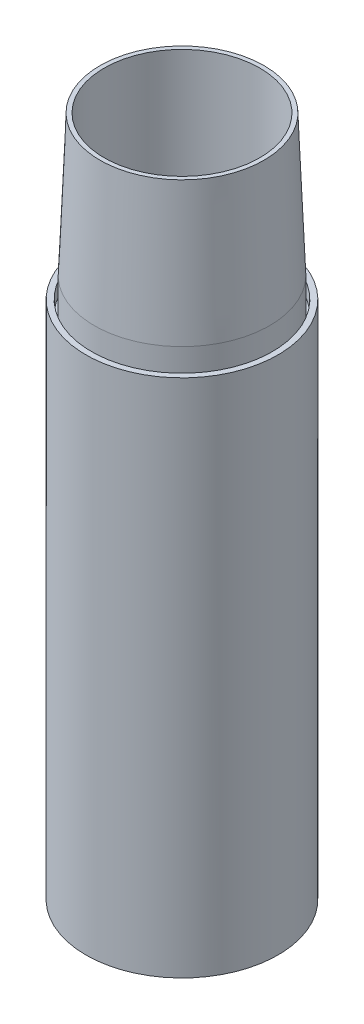
ISO-10303-21;
HEADER;
FILE_DESCRIPTION(('STEP AP214'),'2;1');
FILE_NAME('part.step','',(''),(''),'','','');
FILE_SCHEMA(('AUTOMOTIVE_DESIGN { 1 0 10303 214 1 1 1 1 }'));
ENDSEC;
DATA;
#1=APPLICATION_CONTEXT('core data for automotive mechanical design processes');
#2=APPLICATION_PROTOCOL_DEFINITION('international standard','automotive_design',2000,#1);
#3=PRODUCT_CONTEXT('',#1,'mechanical');
#4=PRODUCT('Part','Part','',(#3));
#5=PRODUCT_RELATED_PRODUCT_CATEGORY('part','',(#4));
#6=PRODUCT_DEFINITION_FORMATION('','',#4);
#7=PRODUCT_DEFINITION_CONTEXT('part definition',#1,'design');
#8=PRODUCT_DEFINITION('design','',#6,#7);
#9=PRODUCT_DEFINITION_SHAPE('','',#8);
#10=(LENGTH_UNIT() NAMED_UNIT(*) SI_UNIT(.MILLI.,.METRE.));
#11=(NAMED_UNIT(*) PLANE_ANGLE_UNIT() SI_UNIT($,.RADIAN.));
#12=(NAMED_UNIT(*) SI_UNIT($,.STERADIAN.) SOLID_ANGLE_UNIT());
#13=UNCERTAINTY_MEASURE_WITH_UNIT(LENGTH_MEASURE(1.E-05),#10,'distance_accuracy_value','');
#14=(GEOMETRIC_REPRESENTATION_CONTEXT(3) GLOBAL_UNCERTAINTY_ASSIGNED_CONTEXT((#13)) GLOBAL_UNIT_ASSIGNED_CONTEXT((#10,
#11,#12)) REPRESENTATION_CONTEXT('',''));
#15=CARTESIAN_POINT('',(0.,0.,0.));
#16=DIRECTION('',(0.,0.,1.));
#17=DIRECTION('',(1.,0.,0.));
#18=AXIS2_PLACEMENT_3D('',#15,#16,#17);
#19=CARTESIAN_POINT('',(0.,70.,0.));
#20=DIRECTION('',(0.,1.,0.));
#21=DIRECTION('',(0.,0.,1.));
#22=AXIS2_PLACEMENT_3D('',#19,#20,#21);
#23=CONICAL_SURFACE('',#22,24.9555,0.03997868712329);
#24=CARTESIAN_POINT('',(0.,30.,0.));
#25=DIRECTION('',(0.,-1.,0.));
#26=DIRECTION('',(0.,0.,-1.));
#27=AXIS2_PLACEMENT_3D('',#24,#25,#26);
#28=CIRCLE('',#27,23.3555);
#29=CARTESIAN_POINT('',(0.,30.,-23.3555));
#30=VERTEX_POINT('',#29);
#31=EDGE_CURVE('E74',#30,#30,#28,.T.);
#32=ORIENTED_EDGE('',*,*,#31,.F.);
#33=EDGE_LOOP('',(#32));
#34=FACE_BOUND('',#33,.T.);
#35=CARTESIAN_POINT('',(0.,70.,0.));
#36=DIRECTION('',(0.,-1.,0.));
#37=DIRECTION('',(0.,0.,-1.));
#38=AXIS2_PLACEMENT_3D('',#35,#36,#37);
#39=CIRCLE('',#38,24.9555);
#40=CARTESIAN_POINT('',(0.,70.,-24.9555));
#41=VERTEX_POINT('',#40);
#42=EDGE_CURVE('E12',#41,#41,#39,.T.);
#43=ORIENTED_EDGE('',*,*,#42,.T.);
#44=EDGE_LOOP('',(#43));
#45=FACE_BOUND('',#44,.T.);
#46=ADVANCED_FACE('F52',(#34,#45),#23,.T.);
#47=CARTESIAN_POINT('',(0.,0.,0.));
#48=DIRECTION('',(0.,-1.,0.));
#49=DIRECTION('',(0.,0.,-1.));
#50=AXIS2_PLACEMENT_3D('',#47,#48,#49);
#51=CYLINDRICAL_SURFACE('',#50,24.9555);
#52=ORIENTED_EDGE('',*,*,#42,.F.);
#53=EDGE_LOOP('',(#52));
#54=FACE_BOUND('',#53,.T.);
#55=CARTESIAN_POINT('',(0.,80.,0.));
#56=DIRECTION('',(0.,-1.,0.));
#57=DIRECTION('',(0.,0.,-1.));
#58=AXIS2_PLACEMENT_3D('',#55,#56,#57);
#59=CIRCLE('',#58,24.9555);
#60=CARTESIAN_POINT('',(0.,80.,-24.9555));
#61=VERTEX_POINT('',#60);
#62=EDGE_CURVE('E58',#61,#61,#59,.T.);
#63=ORIENTED_EDGE('',*,*,#62,.T.);
#64=EDGE_LOOP('',(#63));
#65=FACE_BOUND('',#64,.T.);
#66=ADVANCED_FACE('F81',(#54,#65),#51,.T.);
#67=CARTESIAN_POINT('',(0.,120.,0.));
#68=DIRECTION('',(0.,-1.,0.));
#69=DIRECTION('',(0.,0.,-1.));
#70=AXIS2_PLACEMENT_3D('',#67,#68,#69);
#71=CONICAL_SURFACE('',#70,23.3555,0.0399786871232899);
#72=ORIENTED_EDGE('',*,*,#62,.F.);
#73=EDGE_LOOP('',(#72));
#74=FACE_BOUND('',#73,.T.);
#75=CARTESIAN_POINT('',(0.,120.,0.));
#76=DIRECTION('',(0.,-1.,0.));
#77=DIRECTION('',(0.,0.,-1.));
#78=AXIS2_PLACEMENT_3D('',#75,#76,#77);
#79=CIRCLE('',#78,23.3555);
#80=CARTESIAN_POINT('',(0.,120.,-23.3555));
#81=VERTEX_POINT('',#80);
#82=EDGE_CURVE('E62',#81,#81,#79,.T.);
#83=ORIENTED_EDGE('',*,*,#82,.T.);
#84=EDGE_LOOP('',(#83));
#85=FACE_BOUND('',#84,.T.);
#86=ADVANCED_FACE('F85',(#74,#85),#71,.T.);
#87=CARTESIAN_POINT('',(-23.3555,120.,0.));
#88=DIRECTION('',(0.,-1.,0.));
#89=DIRECTION('',(0.,0.,-1.));
#90=AXIS2_PLACEMENT_3D('',#87,#88,#89);
#91=PLANE('',#90);
#92=ORIENTED_EDGE('',*,*,#82,.F.);
#93=EDGE_LOOP('',(#92));
#94=FACE_BOUND('',#93,.T.);
#95=CARTESIAN_POINT('',(0.,120.,0.));
#96=DIRECTION('',(0.,-1.,0.));
#97=DIRECTION('',(0.,0.,-1.));
#98=AXIS2_PLACEMENT_3D('',#95,#96,#97);
#99=CIRCLE('',#98,22.1555);
#100=CARTESIAN_POINT('',(0.,120.,-22.1555));
#101=VERTEX_POINT('',#100);
#102=EDGE_CURVE('E66',#101,#101,#99,.T.);
#103=ORIENTED_EDGE('',*,*,#102,.T.);
#104=EDGE_LOOP('',(#103));
#105=FACE_BOUND('',#104,.T.);
#106=ADVANCED_FACE('F90',(#94,#105),#91,.F.);
#107=CARTESIAN_POINT('',(0.,0.,0.));
#108=DIRECTION('',(0.,-1.,0.));
#109=DIRECTION('',(0.,0.,-1.));
#110=AXIS2_PLACEMENT_3D('',#107,#108,#109);
#111=CYLINDRICAL_SURFACE('',#110,22.1555);
#112=ORIENTED_EDGE('',*,*,#102,.F.);
#113=EDGE_LOOP('',(#112));
#114=FACE_BOUND('',#113,.T.);
#115=CARTESIAN_POINT('',(0.,30.,0.));
#116=DIRECTION('',(0.,-1.,0.));
#117=DIRECTION('',(0.,0.,-1.));
#118=AXIS2_PLACEMENT_3D('',#115,#116,#117);
#119=CIRCLE('',#118,22.1555);
#120=CARTESIAN_POINT('',(0.,30.,-22.1555));
#121=VERTEX_POINT('',#120);
#122=EDGE_CURVE('E71',#121,#121,#119,.T.);
#123=ORIENTED_EDGE('',*,*,#122,.T.);
#124=EDGE_LOOP('',(#123));
#125=FACE_BOUND('',#124,.T.);
#126=ADVANCED_FACE('F96',(#114,#125),#111,.F.);
#127=CARTESIAN_POINT('',(-22.1555,30.,0.));
#128=DIRECTION('',(0.,1.,0.));
#129=DIRECTION('',(0.,0.,1.));
#130=AXIS2_PLACEMENT_3D('',#127,#128,#129);
#131=PLANE('',#130);
#132=ORIENTED_EDGE('',*,*,#122,.F.);
#133=EDGE_LOOP('',(#132));
#134=FACE_BOUND('',#133,.T.);
#135=ORIENTED_EDGE('',*,*,#31,.T.);
#136=EDGE_LOOP('',(#135));
#137=FACE_BOUND('',#136,.T.);
#138=ADVANCED_FACE('F78',(#134,#137),#131,.F.);
#139=CLOSED_SHELL('',(#46,#66,#86,#106,#126,#138));
#140=MANIFOLD_SOLID_BREP('B2',#139);
#141=CARTESIAN_POINT('',(-25.7555,74.,0.));
#142=DIRECTION('',(0.,-1.,0.));
#143=DIRECTION('',(0.,0.,-1.));
#144=AXIS2_PLACEMENT_3D('',#141,#142,#143);
#145=PLANE('',#144);
#146=CARTESIAN_POINT('',(0.,74.,0.));
#147=DIRECTION('',(0.,-1.,0.));
#148=DIRECTION('',(0.,0.,-1.));
#149=AXIS2_PLACEMENT_3D('',#146,#147,#148);
#150=CIRCLE('',#149,27.3555);
#151=CARTESIAN_POINT('',(0.,74.,-27.3555));
#152=VERTEX_POINT('',#151);
#153=EDGE_CURVE('E290',#152,#152,#150,.T.);
#154=ORIENTED_EDGE('',*,*,#153,.F.);
#155=EDGE_LOOP('',(#154));
#156=FACE_BOUND('',#155,.T.);
#157=CARTESIAN_POINT('',(0.,74.,0.));
#158=DIRECTION('',(0.,-1.,0.));
#159=DIRECTION('',(0.,0.,-1.));
#160=AXIS2_PLACEMENT_3D('',#157,#158,#159);
#161=CIRCLE('',#160,25.7555);
#162=CARTESIAN_POINT('',(0.446614815840973,74.,-25.7516274331599));
#163=VERTEX_POINT('',#162);
#164=CARTESIAN_POINT('',(-0.446614815840973,74.,-25.7516274331599));
#165=VERTEX_POINT('',#164);
#166=EDGE_CURVE('E268',#163,#165,#161,.T.);
#167=ORIENTED_EDGE('',*,*,#166,.T.);
#168=DIRECTION('',(0.347818411576493,0.,-0.937561919325015));
#169=VECTOR('',#168,1.);
#170=CARTESIAN_POINT('',(-11.9060633241085,74.,5.13788899330063));
#171=LINE('',#170,#169);
#172=CARTESIAN_POINT('',(0.,74.,-26.9555));
#173=VERTEX_POINT('',#172);
#174=EDGE_CURVE('E249',#165,#173,#171,.T.);
#175=ORIENTED_EDGE('',*,*,#174,.T.);
#176=DIRECTION('',(0.347818411576493,0.,0.937561919325015));
#177=VECTOR('',#176,1.);
#178=CARTESIAN_POINT('',(5.67438372725962,74.,-11.6599149439853));
#179=LINE('',#178,#177);
#180=EDGE_CURVE('E388',#173,#163,#179,.T.);
#181=ORIENTED_EDGE('',*,*,#180,.T.);
#182=EDGE_LOOP('',(#167,#175,#181));
#183=FACE_BOUND('',#182,.T.);
#184=ADVANCED_FACE('F167',(#156,#183),#145,.F.);
#185=CARTESIAN_POINT('',(0.,0.,0.));
#186=DIRECTION('',(0.,-1.,0.));
#187=DIRECTION('',(0.,0.,-1.));
#188=AXIS2_PLACEMENT_3D('',#185,#186,#187);
#189=CYLINDRICAL_SURFACE('',#188,27.3555);
#190=CARTESIAN_POINT('',(0.,-74.,0.));
#191=DIRECTION('',(0.,1.,0.));
#192=DIRECTION('',(0.,0.,1.));
#193=AXIS2_PLACEMENT_3D('',#190,#191,#192);
#194=CIRCLE('',#193,27.3555);
#195=CARTESIAN_POINT('',(0.,-74.,27.3555));
#196=VERTEX_POINT('',#195);
#197=EDGE_CURVE('E171',#196,#196,#194,.F.);
#198=ORIENTED_EDGE('',*,*,#197,.F.);
#199=EDGE_LOOP('',(#198));
#200=FACE_BOUND('',#199,.T.);
#201=ORIENTED_EDGE('',*,*,#153,.T.);
#202=EDGE_LOOP('',(#201));
#203=FACE_BOUND('',#202,.T.);
#204=ADVANCED_FACE('F348',(#200,#203),#189,.T.);
#205=CARTESIAN_POINT('',(-27.3555,-74.,0.));
#206=DIRECTION('',(0.,1.,0.));
#207=DIRECTION('',(0.,0.,1.));
#208=AXIS2_PLACEMENT_3D('',#205,#206,#207);
#209=PLANE('',#208);
#210=DIRECTION('',(-0.347818411576493,0.,-0.937561919325015));
#211=VECTOR('',#210,1.);
#212=CARTESIAN_POINT('',(5.48081949136907,-74.,-12.1816770200401));
#213=LINE('',#212,#211);
#214=CARTESIAN_POINT('',(0.44661481584098,-74.,-25.7516274331598));
#215=VERTEX_POINT('',#214);
#216=CARTESIAN_POINT('',(0.,-74.,-26.9555));
#217=VERTEX_POINT('',#216);
#218=EDGE_CURVE('E434',#215,#217,#213,.T.);
#219=ORIENTED_EDGE('',*,*,#218,.T.);
#220=DIRECTION('',(-0.347818411576493,0.,0.937561919325015));
#221=VECTOR('',#220,1.);
#222=CARTESIAN_POINT('',(-12.099627559999,-74.,5.6596510693554));
#223=LINE('',#222,#221);
#224=CARTESIAN_POINT('',(-0.44661481584098,-74.,-25.7516274331598));
#225=VERTEX_POINT('',#224);
#226=EDGE_CURVE('E438',#217,#225,#223,.T.);
#227=ORIENTED_EDGE('',*,*,#226,.T.);
#228=CARTESIAN_POINT('',(0.,-74.,0.));
#229=DIRECTION('',(0.,1.,0.));
#230=DIRECTION('',(0.,0.,1.));
#231=AXIS2_PLACEMENT_3D('',#228,#229,#230);
#232=CIRCLE('',#231,25.7555);
#233=EDGE_CURVE('E285',#215,#225,#232,.F.);
#234=ORIENTED_EDGE('',*,*,#233,.F.);
#235=EDGE_LOOP('',(#219,#227,#234));
#236=FACE_BOUND('',#235,.T.);
#237=ORIENTED_EDGE('',*,*,#197,.T.);
#238=EDGE_LOOP('',(#237));
#239=FACE_BOUND('',#238,.T.);
#240=ADVANCED_FACE('F169',(#236,#239),#209,.F.);
#241=CARTESIAN_POINT('',(0.,0.,0.));
#242=DIRECTION('',(0.,-1.,0.));
#243=DIRECTION('',(0.,0.,-1.));
#244=AXIS2_PLACEMENT_3D('',#241,#242,#243);
#245=CYLINDRICAL_SURFACE('',#244,25.7555);
#246=ORIENTED_EDGE('',*,*,#233,.T.);
#247=DIRECTION('',(0.,-1.,0.));
#248=VECTOR('',#247,1.);
#249=CARTESIAN_POINT('',(-0.44661481584098,0.,-25.7516274331598));
#250=LINE('',#249,#248);
#251=CARTESIAN_POINT('',(-0.44661481584098,-70.,-25.7516274331598));
#252=VERTEX_POINT('',#251);
#253=EDGE_CURVE('E211',#225,#252,#250,.F.);
#254=ORIENTED_EDGE('',*,*,#253,.T.);
#255=CARTESIAN_POINT('',(0.,-70.,0.));
#256=DIRECTION('',(0.,-1.,0.));
#257=DIRECTION('',(0.,0.,-1.));
#258=AXIS2_PLACEMENT_3D('',#255,#256,#257);
#259=CIRCLE('',#258,25.7555);
#260=CARTESIAN_POINT('',(0.446614815840974,-70.,-25.7516274331598));
#261=VERTEX_POINT('',#260);
#262=EDGE_CURVE('E282',#261,#252,#259,.T.);
#263=ORIENTED_EDGE('',*,*,#262,.F.);
#264=DIRECTION('',(0.,-1.,0.));
#265=VECTOR('',#264,1.);
#266=CARTESIAN_POINT('',(0.44661481584098,0.,-25.7516274331598));
#267=LINE('',#266,#265);
#268=EDGE_CURVE('E342',#261,#215,#267,.T.);
#269=ORIENTED_EDGE('',*,*,#268,.T.);
#270=EDGE_LOOP('',(#246,#254,#263,#269));
#271=FACE_BOUND('',#270,.T.);
#272=ADVANCED_FACE('F411',(#271),#245,.F.);
#273=CARTESIAN_POINT('',(-24.9555,-70.,0.));
#274=DIRECTION('',(0.,1.,0.));
#275=DIRECTION('',(0.,0.,1.));
#276=AXIS2_PLACEMENT_3D('',#273,#274,#275);
#277=PLANE('',#276);
#278=ORIENTED_EDGE('',*,*,#262,.T.);
#279=DIRECTION('',(-0.347818411576493,0.,0.937561919325015));
#280=VECTOR('',#279,1.);
#281=CARTESIAN_POINT('',(-11.8092812061632,-70.,4.87700795527324));
#282=LINE('',#281,#280);
#283=CARTESIAN_POINT('',(-0.746102174048044,-70.,-24.9443442847448));
#284=VERTEX_POINT('',#283);
#285=EDGE_CURVE('E400',#252,#284,#282,.T.);
#286=ORIENTED_EDGE('',*,*,#285,.T.);
#287=CARTESIAN_POINT('',(0.,-70.,0.));
#288=DIRECTION('',(0.,-1.,0.));
#289=DIRECTION('',(0.,0.,-1.));
#290=AXIS2_PLACEMENT_3D('',#287,#288,#289);
#291=CIRCLE('',#290,24.9555);
#292=CARTESIAN_POINT('',(0.746102174048043,-70.,-24.9443442847448));
#293=VERTEX_POINT('',#292);
#294=EDGE_CURVE('E279',#293,#284,#291,.T.);
#295=ORIENTED_EDGE('',*,*,#294,.F.);
#296=DIRECTION('',(-0.347818411576493,0.,-0.937561919325015));
#297=VECTOR('',#296,1.);
#298=CARTESIAN_POINT('',(5.77116584520489,-70.,-11.3990339059579));
#299=LINE('',#298,#297);
#300=EDGE_CURVE('E447',#293,#261,#299,.T.);
#301=ORIENTED_EDGE('',*,*,#300,.T.);
#302=EDGE_LOOP('',(#278,#286,#295,#301));
#303=FACE_BOUND('',#302,.T.);
#304=ADVANCED_FACE('F407',(#303),#277,.F.);
#305=CARTESIAN_POINT('',(0.,-70.,0.));
#306=DIRECTION('',(0.,-1.,0.));
#307=DIRECTION('',(0.,0.,-1.));
#308=AXIS2_PLACEMENT_3D('',#305,#306,#307);
#309=CONICAL_SURFACE('',#308,24.9555,0.0399786871232897);
#310=ORIENTED_EDGE('',*,*,#294,.T.);
#311=CARTESIAN_POINT('',(-0.746099171549728,-70.0002,-24.9443523781291));
#312=CARTESIAN_POINT('',(-0.796141944074476,-66.6667978893497,-24.80945958265));
#313=CARTESIAN_POINT('',(-0.846250301270814,-63.3334039145014,-24.6743900004094));
#314=CARTESIAN_POINT('',(-0.946606303519952,-56.6666333510345,-24.4038753785468));
#315=CARTESIAN_POINT('',(-0.996853948570488,-53.3332567624158,-24.2684303389308));
#316=CARTESIAN_POINT('',(-1.0974966467452,-46.6665219725292,-23.997142913866));
#317=CARTESIAN_POINT('',(-1.14789169986961,-43.3331637712614,-23.8613005284165));
#318=CARTESIAN_POINT('',(-1.24883838309235,-36.6664669126998,-23.5891936964554));
#319=CARTESIAN_POINT('',(-1.29939001319323,-33.3331282554064,-23.452929249937));
#320=CARTESIAN_POINT('',(-1.3500245154525,-29.9998,-23.316441417372));
#321=B_SPLINE_CURVE_WITH_KNOTS('',3,(#311,#312,#313,#314,#315,#316,#317,#318,#319,#320),
.UNSPECIFIED.,.F.,.F.,(4,2,2,2,4),(0.,10.0095169595683,20.0190337564816,30.0285505689171,
40.0380675440247),.UNSPECIFIED.);
#322=CARTESIAN_POINT('',(-1.35002147736991,-30.,-23.3164496066755));
#323=VERTEX_POINT('',#322);
#324=EDGE_CURVE('E394',#284,#323,#321,.T.);
#325=ORIENTED_EDGE('',*,*,#324,.T.);
#326=CARTESIAN_POINT('',(0.,-30.,0.));
#327=DIRECTION('',(0.,-1.,0.));
#328=DIRECTION('',(0.,0.,-1.));
#329=AXIS2_PLACEMENT_3D('',#326,#327,#328);
#330=CIRCLE('',#329,23.3555);
#331=CARTESIAN_POINT('',(1.35002147736991,-30.,-23.3164496066755));
#332=VERTEX_POINT('',#331);
#333=EDGE_CURVE('E276',#332,#323,#330,.T.);
#334=ORIENTED_EDGE('',*,*,#333,.F.);
#335=CARTESIAN_POINT('',(1.3500245154525,-29.9998,-23.316441417372));
#336=CARTESIAN_POINT('',(1.29939001319324,-33.3331282554064,-23.452929249937));
#337=CARTESIAN_POINT('',(1.24883838309235,-36.6664669126998,-23.5891936964554));
#338=CARTESIAN_POINT('',(1.14789169986961,-43.3331637712614,-23.8613005284165));
#339=CARTESIAN_POINT('',(1.0974966467452,-46.6665219725292,-23.997142913866));
#340=CARTESIAN_POINT('',(0.996853948570486,-53.3332567624158,-24.2684303389308));
#341=CARTESIAN_POINT('',(0.946606303519951,-56.6666333510345,-24.4038753785468));
#342=CARTESIAN_POINT('',(0.846250301270815,-63.3334039145014,-24.6743900004094));
#343=CARTESIAN_POINT('',(0.796141944074477,-66.6667978893497,-24.80945958265));
#344=CARTESIAN_POINT('',(0.746099171549727,-70.0002,-24.9443523781291));
#345=B_SPLINE_CURVE_WITH_KNOTS('',3,(#335,#336,#337,#338,#339,#340,#341,#342,#343,#344),
.UNSPECIFIED.,.F.,.F.,(4,2,2,2,4),(0.,10.0095169751076,20.0190337875431,30.0285505844564,
40.0380675440247),.UNSPECIFIED.);
#346=EDGE_CURVE('E324',#332,#293,#345,.T.);
#347=ORIENTED_EDGE('',*,*,#346,.T.);
#348=EDGE_LOOP('',(#310,#325,#334,#347));
#349=FACE_BOUND('',#348,.T.);
#350=ADVANCED_FACE('F401',(#349),#309,.F.);
#351=CARTESIAN_POINT('',(-23.3555,-30.,0.));
#352=DIRECTION('',(0.,-1.,0.));
#353=DIRECTION('',(0.,0.,-1.));
#354=AXIS2_PLACEMENT_3D('',#351,#352,#353);
#355=PLANE('',#354);
#356=ORIENTED_EDGE('',*,*,#333,.T.);
#357=DIRECTION('',(0.347818411576493,0.,-0.937561919325015));
#358=VECTOR('',#357,1.);
#359=CARTESIAN_POINT('',(-11.6157169702727,-30.,4.35524587921847));
#360=LINE('',#359,#358);
#361=CARTESIAN_POINT('',(-1.08492817836585,-30.,-24.0310218488059));
#362=VERTEX_POINT('',#361);
#363=EDGE_CURVE('E392',#323,#362,#360,.T.);
#364=ORIENTED_EDGE('',*,*,#363,.T.);
#365=CARTESIAN_POINT('',(0.,-30.,0.));
#366=DIRECTION('',(0.,-1.,0.));
#367=DIRECTION('',(0.,0.,-1.));
#368=AXIS2_PLACEMENT_3D('',#365,#366,#367);
#369=CIRCLE('',#368,24.0555);
#370=CARTESIAN_POINT('',(1.08492817836585,-30.,-24.0310218488059));
#371=VERTEX_POINT('',#370);
#372=EDGE_CURVE('E296',#362,#371,#369,.F.);
#373=ORIENTED_EDGE('',*,*,#372,.T.);
#374=DIRECTION('',(0.347818411576493,0.,0.937561919325015));
#375=VECTOR('',#374,1.);
#376=CARTESIAN_POINT('',(5.96473008109545,-30.,-10.8772718299032));
#377=LINE('',#376,#375);
#378=EDGE_CURVE('E186',#371,#332,#377,.T.);
#379=ORIENTED_EDGE('',*,*,#378,.T.);
#380=EDGE_LOOP('',(#356,#364,#373,#379));
#381=FACE_BOUND('',#380,.T.);
#382=ADVANCED_FACE('F406',(#381),#355,.F.);
#383=CARTESIAN_POINT('',(0.,0.,0.));
#384=DIRECTION('',(0.,-1.,0.));
#385=DIRECTION('',(0.,0.,-1.));
#386=AXIS2_PLACEMENT_3D('',#383,#384,#385);
#387=CYLINDRICAL_SURFACE('',#386,26.5555);
#388=CARTESIAN_POINT('',(0.,-27.5,0.));
#389=DIRECTION('',(0.,-1.,0.));
#390=DIRECTION('',(0.,0.,-1.));
#391=AXIS2_PLACEMENT_3D('',#388,#389,#390);
#392=CIRCLE('',#391,26.5555);
#393=CARTESIAN_POINT('',(0.148546855337924,-27.5,-26.5550845240939));
#394=VERTEX_POINT('',#393);
#395=CARTESIAN_POINT('',(-0.148546855337921,-27.5,-26.5550845240939));
#396=VERTEX_POINT('',#395);
#397=EDGE_CURVE('E289',#394,#396,#392,.T.);
#398=ORIENTED_EDGE('',*,*,#397,.T.);
#399=DIRECTION('',(0.,-1.,0.));
#400=VECTOR('',#399,1.);
#401=CARTESIAN_POINT('',(-0.148546855337923,0.,-26.5550845240939));
#402=LINE('',#401,#400);
#403=CARTESIAN_POINT('',(-0.148546855337923,27.5,-26.5550845240939));
#404=VERTEX_POINT('',#403);
#405=EDGE_CURVE('E389',#396,#404,#402,.F.);
#406=ORIENTED_EDGE('',*,*,#405,.T.);
#407=CARTESIAN_POINT('',(0.,27.5,0.));
#408=DIRECTION('',(0.,1.,0.));
#409=DIRECTION('',(0.,0.,1.));
#410=AXIS2_PLACEMENT_3D('',#407,#408,#409);
#411=CIRCLE('',#410,26.5555);
#412=CARTESIAN_POINT('',(0.148546855337923,27.5,-26.5550845240939));
#413=VERTEX_POINT('',#412);
#414=EDGE_CURVE('E293',#404,#413,#411,.T.);
#415=ORIENTED_EDGE('',*,*,#414,.T.);
#416=DIRECTION('',(0.,-1.,0.));
#417=VECTOR('',#416,1.);
#418=CARTESIAN_POINT('',(0.148546855337923,0.,-26.5550845240939));
#419=LINE('',#418,#417);
#420=EDGE_CURVE('E452',#413,#394,#419,.T.);
#421=ORIENTED_EDGE('',*,*,#420,.T.);
#422=EDGE_LOOP('',(#398,#406,#415,#421));
#423=FACE_BOUND('',#422,.T.);
#424=ADVANCED_FACE('F461',(#423),#387,.F.);
#425=CARTESIAN_POINT('',(-26.5555,30.,0.));
#426=DIRECTION('',(0.,1.,0.));
#427=DIRECTION('',(0.,0.,1.));
#428=AXIS2_PLACEMENT_3D('',#425,#426,#427);
#429=PLANE('',#428);
#430=CARTESIAN_POINT('',(0.,30.,0.));
#431=DIRECTION('',(0.,1.,0.));
#432=DIRECTION('',(0.,0.,1.));
#433=AXIS2_PLACEMENT_3D('',#430,#431,#432);
#434=CIRCLE('',#433,24.0555);
#435=CARTESIAN_POINT('',(1.08492817836585,30.,-24.0310218488059));
#436=VERTEX_POINT('',#435);
#437=CARTESIAN_POINT('',(-1.08492817836585,30.,-24.0310218488059));
#438=VERTEX_POINT('',#437);
#439=EDGE_CURVE('E286',#436,#438,#434,.F.);
#440=ORIENTED_EDGE('',*,*,#439,.T.);
#441=DIRECTION('',(-0.347818411576493,0.,0.937561919325015));
#442=VECTOR('',#441,1.);
#443=CARTESIAN_POINT('',(-12.0028454420538,30.,5.39877003132802));
#444=LINE('',#443,#442);
#445=CARTESIAN_POINT('',(-1.3500214773699,30.,-23.3164496066755));
#446=VERTEX_POINT('',#445);
#447=EDGE_CURVE('E360',#438,#446,#444,.T.);
#448=ORIENTED_EDGE('',*,*,#447,.T.);
#449=CARTESIAN_POINT('',(0.,30.,0.));
#450=DIRECTION('',(0.,-1.,0.));
#451=DIRECTION('',(0.,0.,-1.));
#452=AXIS2_PLACEMENT_3D('',#449,#450,#451);
#453=CIRCLE('',#452,23.3555);
#454=CARTESIAN_POINT('',(1.35002147736991,30.,-23.3164496066755));
#455=VERTEX_POINT('',#454);
#456=EDGE_CURVE('E270',#455,#446,#453,.T.);
#457=ORIENTED_EDGE('',*,*,#456,.F.);
#458=DIRECTION('',(-0.347818411576493,0.,-0.937561919325015));
#459=VECTOR('',#458,1.);
#460=CARTESIAN_POINT('',(5.57760160931435,30.,-11.9207959820127));
#461=LINE('',#460,#459);
#462=EDGE_CURVE('E341',#455,#436,#461,.T.);
#463=ORIENTED_EDGE('',*,*,#462,.T.);
#464=EDGE_LOOP('',(#440,#448,#457,#463));
#465=FACE_BOUND('',#464,.T.);
#466=ADVANCED_FACE('F374',(#465),#429,.F.);
#467=CARTESIAN_POINT('',(0.,30.,0.));
#468=DIRECTION('',(0.,1.,0.));
#469=DIRECTION('',(0.,0.,1.));
#470=AXIS2_PLACEMENT_3D('',#467,#468,#469);
#471=CONICAL_SURFACE('',#470,23.3555,0.03997868712329);
#472=ORIENTED_EDGE('',*,*,#456,.T.);
#473=CARTESIAN_POINT('',(-1.35002451545249,29.9998,-23.316441417372));
#474=CARTESIAN_POINT('',(-1.29939001319323,33.3331282554064,-23.452929249937));
#475=CARTESIAN_POINT('',(-1.24883838309235,36.6664669126998,-23.5891936964554));
#476=CARTESIAN_POINT('',(-1.14789169986961,43.3331637712614,-23.8613005284165));
#477=CARTESIAN_POINT('',(-1.0974966467452,46.6665219725292,-23.997142913866));
#478=CARTESIAN_POINT('',(-0.996853948570483,53.3332567624158,-24.2684303389308));
#479=CARTESIAN_POINT('',(-0.946606303519947,56.6666333510345,-24.4038753785468));
#480=CARTESIAN_POINT('',(-0.846250301270808,63.3334039145014,-24.6743900004095));
#481=CARTESIAN_POINT('',(-0.79614194407447,66.6667978893497,-24.8094595826501));
#482=CARTESIAN_POINT('',(-0.746099171549722,70.0002,-24.9443523781291));
#483=B_SPLINE_CURVE_WITH_KNOTS('',3,(#473,#474,#475,#476,#477,#478,#479,#480,#481,#482),
.UNSPECIFIED.,.F.,.F.,(4,2,2,2,4),(0.,10.0095169751076,20.0190337875431,30.0285505844564,
40.0380675440247),.UNSPECIFIED.);
#484=CARTESIAN_POINT('',(-0.746102174048038,70.,-24.9443442847448));
#485=VERTEX_POINT('',#484);
#486=EDGE_CURVE('E263',#446,#485,#483,.T.);
#487=ORIENTED_EDGE('',*,*,#486,.T.);
#488=CARTESIAN_POINT('',(0.,70.,0.));
#489=DIRECTION('',(0.,-1.,0.));
#490=DIRECTION('',(0.,0.,-1.));
#491=AXIS2_PLACEMENT_3D('',#488,#489,#490);
#492=CIRCLE('',#491,24.9555);
#493=CARTESIAN_POINT('',(0.746102174048038,70.,-24.9443442847448));
#494=VERTEX_POINT('',#493);
#495=EDGE_CURVE('E262',#494,#485,#492,.T.);
#496=ORIENTED_EDGE('',*,*,#495,.F.);
#497=CARTESIAN_POINT('',(0.746099171549722,70.0002,-24.9443523781291));
#498=CARTESIAN_POINT('',(0.79614194407447,66.6667978893497,-24.8094595826501));
#499=CARTESIAN_POINT('',(0.846250301270808,63.3334039145014,-24.6743900004095));
#500=CARTESIAN_POINT('',(0.946606303519946,56.6666333510345,-24.4038753785468));
#501=CARTESIAN_POINT('',(0.996853948570483,53.3332567624158,-24.2684303389308));
#502=CARTESIAN_POINT('',(1.0974966467452,46.6665219725292,-23.997142913866));
#503=CARTESIAN_POINT('',(1.14789169986961,43.3331637712614,-23.8613005284165));
#504=CARTESIAN_POINT('',(1.24883838309235,36.6664669126998,-23.5891936964554));
#505=CARTESIAN_POINT('',(1.29939001319323,33.3331282554064,-23.452929249937));
#506=CARTESIAN_POINT('',(1.35002451545249,29.9998,-23.316441417372));
#507=B_SPLINE_CURVE_WITH_KNOTS('',3,(#497,#498,#499,#500,#501,#502,#503,#504,#505,#506),
.UNSPECIFIED.,.F.,.F.,(4,2,2,2,4),(0.,10.0095169595683,20.0190337564816,30.0285505689172,
40.0380675440247),.UNSPECIFIED.);
#508=EDGE_CURVE('E378',#494,#455,#507,.T.);
#509=ORIENTED_EDGE('',*,*,#508,.T.);
#510=EDGE_LOOP('',(#472,#487,#496,#509));
#511=FACE_BOUND('',#510,.T.);
#512=ADVANCED_FACE('F369',(#511),#471,.F.);
#513=CARTESIAN_POINT('',(-24.9555,70.,0.));
#514=DIRECTION('',(0.,-1.,0.));
#515=DIRECTION('',(0.,0.,-1.));
#516=AXIS2_PLACEMENT_3D('',#513,#514,#515);
#517=PLANE('',#516);
#518=ORIENTED_EDGE('',*,*,#495,.T.);
#519=DIRECTION('',(0.347818411576493,0.,-0.937561919325015));
#520=VECTOR('',#519,1.);
#521=CARTESIAN_POINT('',(-11.8092812061632,70.,4.87700795527324));
#522=LINE('',#521,#520);
#523=CARTESIAN_POINT('',(-0.446614815840971,70.,-25.7516274331599));
#524=VERTEX_POINT('',#523);
#525=EDGE_CURVE('E242',#485,#524,#522,.T.);
#526=ORIENTED_EDGE('',*,*,#525,.T.);
#527=CARTESIAN_POINT('',(0.,70.,0.));
#528=DIRECTION('',(0.,-1.,0.));
#529=DIRECTION('',(0.,0.,-1.));
#530=AXIS2_PLACEMENT_3D('',#527,#528,#529);
#531=CIRCLE('',#530,25.7555);
#532=CARTESIAN_POINT('',(0.446614815840971,70.,-25.7516274331599));
#533=VERTEX_POINT('',#532);
#534=EDGE_CURVE('E260',#533,#524,#531,.T.);
#535=ORIENTED_EDGE('',*,*,#534,.F.);
#536=DIRECTION('',(0.347818411576493,0.,0.937561919325015));
#537=VECTOR('',#536,1.);
#538=CARTESIAN_POINT('',(5.7711658452049,70.,-11.3990339059579));
#539=LINE('',#538,#537);
#540=EDGE_CURVE('E385',#533,#494,#539,.T.);
#541=ORIENTED_EDGE('',*,*,#540,.T.);
#542=EDGE_LOOP('',(#518,#526,#535,#541));
#543=FACE_BOUND('',#542,.T.);
#544=ADVANCED_FACE('F258',(#543),#517,.F.);
#545=CARTESIAN_POINT('',(0.,0.,0.));
#546=DIRECTION('',(0.,-1.,0.));
#547=DIRECTION('',(0.,0.,-1.));
#548=AXIS2_PLACEMENT_3D('',#545,#546,#547);
#549=CYLINDRICAL_SURFACE('',#548,25.7555);
#550=ORIENTED_EDGE('',*,*,#534,.T.);
#551=DIRECTION('',(0.,-1.,0.));
#552=VECTOR('',#551,1.);
#553=CARTESIAN_POINT('',(-0.446614815840973,0.,-25.7516274331599));
#554=LINE('',#553,#552);
#555=EDGE_CURVE('E245',#524,#165,#554,.F.);
#556=ORIENTED_EDGE('',*,*,#555,.T.);
#557=ORIENTED_EDGE('',*,*,#166,.F.);
#558=DIRECTION('',(0.,-1.,0.));
#559=VECTOR('',#558,1.);
#560=CARTESIAN_POINT('',(0.446614815840973,0.,-25.7516274331599));
#561=LINE('',#560,#559);
#562=EDGE_CURVE('E267',#163,#533,#561,.T.);
#563=ORIENTED_EDGE('',*,*,#562,.T.);
#564=EDGE_LOOP('',(#550,#556,#557,#563));
#565=FACE_BOUND('',#564,.T.);
#566=ADVANCED_FACE('F266',(#565),#549,.F.);
#567=CARTESIAN_POINT('',(0.,27.5,0.));
#568=DIRECTION('',(0.,1.,0.));
#569=DIRECTION('',(0.,0.,1.));
#570=AXIS2_PLACEMENT_3D('',#567,#568,#569);
#571=TOROIDAL_SURFACE('',#570,24.0555,2.5);
#572=ORIENTED_EDGE('',*,*,#414,.F.);
#573=CARTESIAN_POINT('',(-0.148546858311995,27.4998,-26.5550845160771));
#574=CARTESIAN_POINT('',(-0.148541650009914,27.5667525358084,-26.5550985553158));
#575=CARTESIAN_POINT('',(-0.149542698686776,27.6337008663729,-26.5524001785548));
#576=CARTESIAN_POINT('',(-0.153532610004685,27.7670952144746,-26.5416451731019));
#577=CARTESIAN_POINT('',(-0.156521139959754,27.8335413141984,-26.5335894411815));
#578=CARTESIAN_POINT('',(-0.164452034827259,27.9653056250664,-26.5122113175214));
#579=CARTESIAN_POINT('',(-0.169389809610809,28.030626112381,-26.4989012987036));
#580=CARTESIAN_POINT('',(-0.181166747337277,28.1598162965515,-26.467155974215));
#581=CARTESIAN_POINT('',(-0.18800593031418,28.2236859781135,-26.4487206145416));
#582=CARTESIAN_POINT('',(-0.211287490297005,28.4124360419367,-26.3859640055299));
#583=CARTESIAN_POINT('',(-0.230502021682905,28.5345909792179,-26.3341702754526));
#584=CARTESIAN_POINT('',(-0.2756141874473,28.768145595486,-26.2125681770264));
#585=CARTESIAN_POINT('',(-0.30151345996552,28.8795426289701,-26.1427553929899));
#586=CARTESIAN_POINT('',(-0.359865078216107,29.0916892737886,-25.9854656884146));
#587=CARTESIAN_POINT('',(-0.392465050254419,29.192103117995,-25.8975908337867));
#588=CARTESIAN_POINT('',(-0.462764934581508,29.3768743737384,-25.7080939805888));
#589=CARTESIAN_POINT('',(-0.50046643890948,29.4612267531013,-25.6064676905975));
#590=CARTESIAN_POINT('',(-0.582336995854158,29.6170195890342,-25.3857815108253));
#591=CARTESIAN_POINT('',(-0.626760714749696,29.6873531329829,-25.2660351553564));
#592=CARTESIAN_POINT('',(-0.718883179314375,29.8071553691858,-25.0177144459991));
#593=CARTESIAN_POINT('',(-0.766582756641537,29.8566187400896,-24.8891378503349));
#594=CARTESIAN_POINT('',(-0.867404652083363,29.9367814023443,-24.6173673900767));
#595=CARTESIAN_POINT('',(-0.920674132309862,29.9659524841599,-24.4737768426521));
#596=CARTESIAN_POINT('',(-1.02815147532137,29.9996063704369,-24.1840662906975));
#597=CARTESIAN_POINT('',(-1.08235964579671,30.0040809199275,-24.0379454567727));
#598=CARTESIAN_POINT('',(-1.19324466009041,29.9880875290893,-23.7390493564933));
#599=CARTESIAN_POINT('',(-1.2498984992783,29.9662729588722,-23.5863361002704));
#600=CARTESIAN_POINT('',(-1.36117965839023,29.8959616318784,-23.2863721718262));
#601=CARTESIAN_POINT('',(-1.41580657260679,29.8474595637816,-23.1391225932098));
#602=CARTESIAN_POINT('',(-1.52205132173186,29.7239441167321,-22.8527345597057));
#603=CARTESIAN_POINT('',(-1.57362773453726,29.6486346970136,-22.7137077601681));
#604=CARTESIAN_POINT('',(-1.67135726912972,29.4729829481828,-22.4502729131974));
#605=CARTESIAN_POINT('',(-1.71751157222497,29.3726460867013,-22.325861681489));
#606=CARTESIAN_POINT('',(-1.80047616465836,29.1545650917577,-22.1022264743551));
#607=CARTESIAN_POINT('',(-1.83763421244141,29.0379188899274,-22.0020650986536));
#608=CARTESIAN_POINT('',(-1.90375616678998,28.7867304449297,-21.8238300646093));
#609=CARTESIAN_POINT('',(-1.93272296775066,28.6521945478931,-21.7457486042797));
#610=CARTESIAN_POINT('',(-1.97863579415672,28.3826445980708,-21.6219882850608));
#611=CARTESIAN_POINT('',(-1.99645930895117,28.2488779889872,-21.5739441097567));
#612=CARTESIAN_POINT('',(-2.01650139557148,28.0431579439752,-21.5199196631673));
#613=CARTESIAN_POINT('',(-2.02206526652355,27.9737813804559,-21.5049219708224));
#614=CARTESIAN_POINT('',(-2.03090666766057,27.8338482746271,-21.4810895319875));
#615=CARTESIAN_POINT('',(-2.03418575976124,27.7632925722517,-21.4722505752756));
#616=CARTESIAN_POINT('',(-2.03725474126573,27.6604165763307,-21.4639779821811));
#617=CARTESIAN_POINT('',(-2.03797206210259,27.6283036558956,-21.4620444079994));
#618=CARTESIAN_POINT('',(-2.03892708389598,27.5640622426492,-21.4594700990042));
#619=CARTESIAN_POINT('',(-2.03916542939085,27.5319338290355,-21.4588276268055));
#620=CARTESIAN_POINT('',(-2.03916451700837,27.4998,-21.4588300861781));
#621=B_SPLINE_CURVE_WITH_KNOTS('',3,(#573,#574,#575,#576,#577,#578,#579,#580,#581,#582,#583,
#584,#585,#586,#587,#588,#589,#590,#591,#592,#593,#594,#595,#596,#597,#598,#599,#600,#601,#602,
#603,#604,#605,#606,#607,#608,#609,#610,#611,#612,#613,#614,#615,#616,#617,#618,#619,#620),
.UNSPECIFIED.,.F.,.F.,(4,2,2,2,2,2,2,2,2,2,2,2,2,2,2,2,2,2,2,2,2,2,2,4),(0.,0.200787846831293,
0.401542092091603,0.60182638969364,0.802112797649744,1.20228403427498,1.60255342875153,
2.0128285320185,2.42323196672021,2.85876562203297,3.29441026006841,3.7600802047043,
4.22590579301415,4.71664204477528,5.20747599773667,5.70390768249485,6.20023100893526,
6.67216044064492,7.14392290607685,7.57108891004552,7.7844239855902,7.99761307799176,
8.09412624868545,8.19050945819036),.UNSPECIFIED.);
#622=EDGE_CURVE('E352',#404,#438,#621,.T.);
#623=ORIENTED_EDGE('',*,*,#622,.T.);
#624=ORIENTED_EDGE('',*,*,#439,.F.);
#625=CARTESIAN_POINT('',(2.03916451700837,27.4998,-21.4588300861781));
#626=CARTESIAN_POINT('',(2.03917058726021,27.5652652409862,-21.4588137235107));
#627=CARTESIAN_POINT('',(2.03817539496882,27.6307249922197,-21.4614963140918));
#628=CARTESIAN_POINT('',(2.03421350778093,27.7611318374012,-21.4721757791011));
#629=CARTESIAN_POINT('',(2.03124735911592,27.8260790683443,-21.4801711811351));
#630=CARTESIAN_POINT('',(2.02338840656333,27.954769119424,-21.5013553806882));
#631=CARTESIAN_POINT('',(2.01850242091157,28.0185153742331,-21.5145257993118));
#632=CARTESIAN_POINT('',(2.00686623257671,28.1445690707214,-21.5458917267778));
#633=CARTESIAN_POINT('',(2.00011596762434,28.2068764642655,-21.5640874034702));
#634=CARTESIAN_POINT('',(1.97718343007595,28.3909166582671,-21.6259032050588));
#635=CARTESIAN_POINT('',(1.9583069910339,28.5099669681648,-21.6767855903186));
#636=CARTESIAN_POINT('',(1.91415629851461,28.7377688091761,-21.7957959895389));
#637=CARTESIAN_POINT('',(1.8888780081875,28.8465137823182,-21.8639348850302));
#638=CARTESIAN_POINT('',(1.83160909112771,29.0559597360822,-22.0183061144107));
#639=CARTESIAN_POINT('',(1.7993763444664,29.1561128771869,-22.1051910946736));
#640=CARTESIAN_POINT('',(1.72997220051894,29.3410686192019,-22.2922734348912));
#641=CARTESIAN_POINT('',(1.69279907645213,29.4258658282489,-22.3924754494695));
#642=CARTESIAN_POINT('',(1.61086171489897,29.5860327968405,-22.6133417044041));
#643=CARTESIAN_POINT('',(1.56571258340152,29.6597757139396,-22.735043445812));
#644=CARTESIAN_POINT('',(1.47199090895003,29.7862806091797,-22.9876749053797));
#645=CARTESIAN_POINT('',(1.4234171634377,29.8390351735963,-23.1186078650955));
#646=CARTESIAN_POINT('',(1.32009447057841,29.9261089946086,-23.3971193498324));
#647=CARTESIAN_POINT('',(1.26516149879004,29.9586308558197,-23.5451939219365));
#648=CARTESIAN_POINT('',(1.15417970183512,29.9976524755535,-23.8443509047183));
#649=CARTESIAN_POINT('',(1.09813056659954,30.0041448988524,-23.9954341512026));
#650=CARTESIAN_POINT('',(0.984567518691554,29.9905245577652,-24.301549024991));
#651=CARTESIAN_POINT('',(0.927065871600374,29.9695320315923,-24.4565475898076));
#652=CARTESIAN_POINT('',(0.81416281002051,29.8994232534045,-24.7608834374492));
#653=CARTESIAN_POINT('',(0.75876129005546,29.8503084157995,-24.910221004591));
#654=CARTESIAN_POINT('',(0.653119048178008,29.7260917254712,-25.1949849496838));
#655=CARTESIAN_POINT('',(0.602787105442015,29.6516336695331,-25.3306572179258));
#656=CARTESIAN_POINT('',(0.507591876649127,29.4779069491724,-25.5872607168984));
#657=CARTESIAN_POINT('',(0.462726304330774,29.3786487105667,-25.7081981103612));
#658=CARTESIAN_POINT('',(0.382861749625062,29.1648163009013,-25.9234770107982));
#659=CARTESIAN_POINT('',(0.347416023047961,29.0516224896769,-26.0190227390731));
#660=CARTESIAN_POINT('',(0.284246842247317,28.8085579914595,-26.1892984243802));
#661=CARTESIAN_POINT('',(0.256522271913843,28.6786897187656,-26.2640313899426));
#662=CARTESIAN_POINT('',(0.211669951000321,28.416087194132,-26.3849330635811));
#663=CARTESIAN_POINT('',(0.193927774763012,28.2842169028993,-26.4327579867375));
#664=CARTESIAN_POINT('',(0.166892537974893,28.0136370731841,-26.5056328192618));
#665=CARTESIAN_POINT('',(0.15758219431775,27.8749421419278,-26.5307293161068));
#666=CARTESIAN_POINT('',(0.151292927963295,27.6960545028676,-26.5476823480285));
#667=CARTESIAN_POINT('',(0.150261768039859,27.6568305785553,-26.5504618911601));
#668=CARTESIAN_POINT('',(0.148889175687666,27.5783433814255,-26.5541617824751));
#669=CARTESIAN_POINT('',(0.148546687283434,27.5390802613523,-26.5550849770931));
#670=CARTESIAN_POINT('',(0.148546858311995,27.4998,-26.5550845160771));
#671=B_SPLINE_CURVE_WITH_KNOTS('',3,(#625,#626,#627,#628,#629,#630,#631,#632,#633,#634,#635,
#636,#637,#638,#639,#640,#641,#642,#643,#644,#645,#646,#647,#648,#649,#650,#651,#652,#653,#654,
#655,#656,#657,#658,#659,#660,#661,#662,#663,#664,#665,#666,#667,#668,#669,#670),.UNSPECIFIED.,
.F.,.F.,(4,2,2,2,2,2,2,2,2,2,2,2,2,2,2,2,2,2,2,2,2,2,4),(0.,0.196323275483047,0.392592164549002,
0.588170221625789,0.783754812046919,1.17432369331709,1.56513947360933,1.97278005978375,
2.3805635027088,2.82654010111947,3.27267409245561,3.75424856187313,4.23595873181413,
4.73347125536908,5.23095875875884,5.71665023507139,6.20213787274649,6.65666565158156,
7.11112769329407,7.53319920941463,7.95440361551513,8.07237858882074,8.19017252666082),.UNSPECIFIED.);
#672=EDGE_CURVE('E333',#436,#413,#671,.T.);
#673=ORIENTED_EDGE('',*,*,#672,.T.);
#674=EDGE_LOOP('',(#572,#623,#624,#673));
#675=FACE_BOUND('',#674,.T.);
#676=ADVANCED_FACE('F343',(#675),#571,.F.);
#677=CARTESIAN_POINT('',(0.,-27.5,0.));
#678=DIRECTION('',(0.,-1.,0.));
#679=DIRECTION('',(0.,0.,-1.));
#680=AXIS2_PLACEMENT_3D('',#677,#678,#679);
#681=TOROIDAL_SURFACE('',#680,24.0555,2.5);
#682=ORIENTED_EDGE('',*,*,#372,.F.);
#683=CARTESIAN_POINT('',(-2.03916451700837,-27.4998,-21.4588300861781));
#684=CARTESIAN_POINT('',(-2.03917058726021,-27.5652652409862,-21.4588137235107));
#685=CARTESIAN_POINT('',(-2.03817539496882,-27.6307249922198,-21.4614963140918));
#686=CARTESIAN_POINT('',(-2.03421350778093,-27.7611318374012,-21.4721757791011));
#687=CARTESIAN_POINT('',(-2.03124735911591,-27.8260790683443,-21.4801711811351));
#688=CARTESIAN_POINT('',(-2.02338840656333,-27.954769119424,-21.5013553806882));
#689=CARTESIAN_POINT('',(-2.01850242091157,-28.0185153742331,-21.5145257993118));
#690=CARTESIAN_POINT('',(-2.00686623257671,-28.1445690707214,-21.5458917267778));
#691=CARTESIAN_POINT('',(-2.00011596762434,-28.2068764642655,-21.5640874034702));
#692=CARTESIAN_POINT('',(-1.97718343007594,-28.3909166582671,-21.6259032050588));
#693=CARTESIAN_POINT('',(-1.9583069910339,-28.5099669681648,-21.6767855903186));
#694=CARTESIAN_POINT('',(-1.91415629851461,-28.7377688091761,-21.7957959895389));
#695=CARTESIAN_POINT('',(-1.8888780081875,-28.8465137823182,-21.8639348850302));
#696=CARTESIAN_POINT('',(-1.83160909112771,-29.0559597360822,-22.0183061144107));
#697=CARTESIAN_POINT('',(-1.7993763444664,-29.1561128771869,-22.1051910946736));
#698=CARTESIAN_POINT('',(-1.72997220051895,-29.3410686192019,-22.2922734348912));
#699=CARTESIAN_POINT('',(-1.69279907645213,-29.4258658282489,-22.3924754494695));
#700=CARTESIAN_POINT('',(-1.61086171489897,-29.5860327968405,-22.6133417044041));
#701=CARTESIAN_POINT('',(-1.56571258340152,-29.6597757139396,-22.735043445812));
#702=CARTESIAN_POINT('',(-1.47199090895004,-29.7862806091797,-22.9876749053797));
#703=CARTESIAN_POINT('',(-1.4234171634377,-29.8390351735964,-23.1186078650955));
#704=CARTESIAN_POINT('',(-1.32009447057841,-29.9261089946086,-23.3971193498324));
#705=CARTESIAN_POINT('',(-1.26516149879004,-29.9586308558197,-23.5451939219365));
#706=CARTESIAN_POINT('',(-1.15417970183513,-29.9976524755535,-23.8443509047183));
#707=CARTESIAN_POINT('',(-1.09813056659954,-30.0041448988525,-23.9954341512026));
#708=CARTESIAN_POINT('',(-0.984567518691553,-29.9905245577652,-24.301549024991));
#709=CARTESIAN_POINT('',(-0.927065871600373,-29.9695320315923,-24.4565475898076));
#710=CARTESIAN_POINT('',(-0.81416281002051,-29.8994232534045,-24.7608834374492));
#711=CARTESIAN_POINT('',(-0.75876129005546,-29.8503084157995,-24.910221004591));
#712=CARTESIAN_POINT('',(-0.653119048178008,-29.7260917254712,-25.1949849496838));
#713=CARTESIAN_POINT('',(-0.602787105442015,-29.6516336695331,-25.3306572179258));
#714=CARTESIAN_POINT('',(-0.507591876649127,-29.4779069491724,-25.5872607168984));
#715=CARTESIAN_POINT('',(-0.462726304330774,-29.3786487105667,-25.7081981103612));
#716=CARTESIAN_POINT('',(-0.382861749625061,-29.1648163009013,-25.9234770107982));
#717=CARTESIAN_POINT('',(-0.347416023047959,-29.0516224896769,-26.0190227390731));
#718=CARTESIAN_POINT('',(-0.284246842247316,-28.8085579914595,-26.1892984243802));
#719=CARTESIAN_POINT('',(-0.256522271913843,-28.6786897187657,-26.2640313899426));
#720=CARTESIAN_POINT('',(-0.211669951000322,-28.416087194132,-26.3849330635811));
#721=CARTESIAN_POINT('',(-0.193927774763013,-28.2842169028993,-26.4327579867375));
#722=CARTESIAN_POINT('',(-0.166892537974893,-28.0136370731841,-26.5056328192618));
#723=CARTESIAN_POINT('',(-0.157582194317748,-27.8749421419278,-26.5307293161068));
#724=CARTESIAN_POINT('',(-0.151292927963294,-27.6960545028676,-26.5476823480285));
#725=CARTESIAN_POINT('',(-0.150261768039859,-27.6568305785553,-26.5504618911601));
#726=CARTESIAN_POINT('',(-0.148889175687667,-27.5783433814255,-26.5541617824751));
#727=CARTESIAN_POINT('',(-0.148546687283435,-27.5390802613523,-26.5550849770931));
#728=CARTESIAN_POINT('',(-0.148546858311995,-27.4998,-26.5550845160771));
#729=B_SPLINE_CURVE_WITH_KNOTS('',3,(#683,#684,#685,#686,#687,#688,#689,#690,#691,#692,#693,
#694,#695,#696,#697,#698,#699,#700,#701,#702,#703,#704,#705,#706,#707,#708,#709,#710,#711,#712,
#713,#714,#715,#716,#717,#718,#719,#720,#721,#722,#723,#724,#725,#726,#727,#728),.UNSPECIFIED.,
.F.,.F.,(4,2,2,2,2,2,2,2,2,2,2,2,2,2,2,2,2,2,2,2,2,2,4),(0.,0.196323275483043,0.392592164548998,
0.588170221625797,0.783754812046918,1.17432369331709,1.56513947360933,1.97278005978374,
2.3805635027088,2.82654010111947,3.27267409245561,3.75424856187313,4.23595873181413,
4.73347125536908,5.23095875875884,5.71665023507139,6.20213787274649,6.65666565158156,
7.11112769329407,7.53319920941464,7.95440361551513,8.07237858882075,8.19017252666082),.UNSPECIFIED.);
#730=EDGE_CURVE('E50',#362,#396,#729,.T.);
#731=ORIENTED_EDGE('',*,*,#730,.T.);
#732=ORIENTED_EDGE('',*,*,#397,.F.);
#733=CARTESIAN_POINT('',(0.148546858311994,-27.4998,-26.5550845160771));
#734=CARTESIAN_POINT('',(0.148541650009915,-27.5667525358084,-26.5550985553158));
#735=CARTESIAN_POINT('',(0.149542698686777,-27.6337008663729,-26.5524001785548));
#736=CARTESIAN_POINT('',(0.153532610004684,-27.7670952144746,-26.5416451731019));
#737=CARTESIAN_POINT('',(0.156521139959752,-27.8335413141985,-26.5335894411815));
#738=CARTESIAN_POINT('',(0.164452034827258,-27.9653056250664,-26.5122113175214));
#739=CARTESIAN_POINT('',(0.169389809610808,-28.030626112381,-26.4989012987036));
#740=CARTESIAN_POINT('',(0.181166747337277,-28.1598162965516,-26.467155974215));
#741=CARTESIAN_POINT('',(0.18800593031418,-28.2236859781135,-26.4487206145416));
#742=CARTESIAN_POINT('',(0.211287490297005,-28.4124360419367,-26.3859640055299));
#743=CARTESIAN_POINT('',(0.230502021682905,-28.5345909792179,-26.3341702754526));
#744=CARTESIAN_POINT('',(0.2756141874473,-28.7681455954861,-26.2125681770264));
#745=CARTESIAN_POINT('',(0.30151345996552,-28.8795426289701,-26.1427553929899));
#746=CARTESIAN_POINT('',(0.359865078216107,-29.0916892737886,-25.9854656884146));
#747=CARTESIAN_POINT('',(0.39246505025442,-29.192103117995,-25.8975908337867));
#748=CARTESIAN_POINT('',(0.462764934581509,-29.3768743737384,-25.7080939805888));
#749=CARTESIAN_POINT('',(0.500466438909481,-29.4612267531013,-25.6064676905975));
#750=CARTESIAN_POINT('',(0.582336995854159,-29.6170195890342,-25.3857815108253));
#751=CARTESIAN_POINT('',(0.626760714749695,-29.6873531329829,-25.2660351553564));
#752=CARTESIAN_POINT('',(0.718883179314374,-29.8071553691858,-25.0177144459991));
#753=CARTESIAN_POINT('',(0.766582756641536,-29.8566187400896,-24.8891378503349));
#754=CARTESIAN_POINT('',(0.867404652083362,-29.9367814023443,-24.6173673900767));
#755=CARTESIAN_POINT('',(0.92067413230986,-29.9659524841599,-24.4737768426521));
#756=CARTESIAN_POINT('',(1.02815147532137,-29.9996063704369,-24.1840662906975));
#757=CARTESIAN_POINT('',(1.08235964579671,-30.0040809199275,-24.0379454567727));
#758=CARTESIAN_POINT('',(1.19324466009041,-29.9880875290893,-23.7390493564933));
#759=CARTESIAN_POINT('',(1.2498984992783,-29.9662729588722,-23.5863361002704));
#760=CARTESIAN_POINT('',(1.36117965839023,-29.8959616318784,-23.2863721718262));
#761=CARTESIAN_POINT('',(1.41580657260679,-29.8474595637816,-23.1391225932098));
#762=CARTESIAN_POINT('',(1.52205132173186,-29.7239441167321,-22.8527345597057));
#763=CARTESIAN_POINT('',(1.57362773453727,-29.6486346970136,-22.7137077601681));
#764=CARTESIAN_POINT('',(1.67135726912972,-29.4729829481828,-22.4502729131974));
#765=CARTESIAN_POINT('',(1.71751157222497,-29.3726460867013,-22.325861681489));
#766=CARTESIAN_POINT('',(1.80047616465836,-29.1545650917577,-22.1022264743551));
#767=CARTESIAN_POINT('',(1.83763421244141,-29.0379188899274,-22.0020650986536));
#768=CARTESIAN_POINT('',(1.90375616678998,-28.7867304449297,-21.8238300646093));
#769=CARTESIAN_POINT('',(1.93272296775066,-28.6521945478931,-21.7457486042797));
#770=CARTESIAN_POINT('',(1.97863579415672,-28.3826445980708,-21.6219882850608));
#771=CARTESIAN_POINT('',(1.99645930895117,-28.2488779889872,-21.5739441097567));
#772=CARTESIAN_POINT('',(2.01650139557148,-28.0431579439752,-21.5199196631673));
#773=CARTESIAN_POINT('',(2.02206526652355,-27.9737813804559,-21.5049219708224));
#774=CARTESIAN_POINT('',(2.03090666766057,-27.8338482746271,-21.4810895319875));
#775=CARTESIAN_POINT('',(2.03418575976124,-27.7632925722517,-21.4722505752756));
#776=CARTESIAN_POINT('',(2.03725474126573,-27.6604165763308,-21.4639779821811));
#777=CARTESIAN_POINT('',(2.03797206210259,-27.6283036558956,-21.4620444079994));
#778=CARTESIAN_POINT('',(2.03892708389598,-27.5640622426492,-21.4594700990042));
#779=CARTESIAN_POINT('',(2.03916542939084,-27.5319338290355,-21.4588276268055));
#780=CARTESIAN_POINT('',(2.03916451700837,-27.4998,-21.4588300861781));
#781=B_SPLINE_CURVE_WITH_KNOTS('',3,(#733,#734,#735,#736,#737,#738,#739,#740,#741,#742,#743,
#744,#745,#746,#747,#748,#749,#750,#751,#752,#753,#754,#755,#756,#757,#758,#759,#760,#761,#762,
#763,#764,#765,#766,#767,#768,#769,#770,#771,#772,#773,#774,#775,#776,#777,#778,#779,#780),
.UNSPECIFIED.,.F.,.F.,(4,2,2,2,2,2,2,2,2,2,2,2,2,2,2,2,2,2,2,2,2,2,2,4),(0.,0.200787846831293,
0.401542092091603,0.60182638969364,0.802112797649744,1.20228403427498,1.60255342875153,
2.0128285320185,2.42323196672021,2.85876562203297,3.2944102600684,3.76008020470429,
4.22590579301414,4.71664204477528,5.20747599773667,5.70390768249486,6.20023100893527,
6.67216044064493,7.14392290607685,7.57108891004551,7.7844239855902,7.99761307799175,
8.09412624868545,8.19050945819036),.UNSPECIFIED.);
#782=EDGE_CURVE('E177',#394,#371,#781,.T.);
#783=ORIENTED_EDGE('',*,*,#782,.T.);
#784=EDGE_LOOP('',(#682,#731,#732,#783));
#785=FACE_BOUND('',#784,.T.);
#786=ADVANCED_FACE('F311',(#785),#681,.F.);
#787=CARTESIAN_POINT('',(0.,-75.,-26.9555));
#788=DIRECTION('',(-0.937561919325015,0.,-0.347818411576493));
#789=DIRECTION('',(-0.347818411576493,0.,0.937561919325015));
#790=AXIS2_PLACEMENT_3D('',#787,#788,#789);
#791=PLANE('',#790);
#792=ORIENTED_EDGE('',*,*,#555,.F.);
#793=ORIENTED_EDGE('',*,*,#525,.F.);
#794=ORIENTED_EDGE('',*,*,#486,.F.);
#795=ORIENTED_EDGE('',*,*,#447,.F.);
#796=ORIENTED_EDGE('',*,*,#622,.F.);
#797=ORIENTED_EDGE('',*,*,#405,.F.);
#798=ORIENTED_EDGE('',*,*,#730,.F.);
#799=ORIENTED_EDGE('',*,*,#363,.F.);
#800=ORIENTED_EDGE('',*,*,#324,.F.);
#801=ORIENTED_EDGE('',*,*,#285,.F.);
#802=ORIENTED_EDGE('',*,*,#253,.F.);
#803=ORIENTED_EDGE('',*,*,#226,.F.);
#804=DIRECTION('',(0.,1.,0.));
#805=VECTOR('',#804,1.);
#806=CARTESIAN_POINT('',(0.,-75.,-26.9555));
#807=LINE('',#806,#805);
#808=EDGE_CURVE('E437',#217,#173,#807,.T.);
#809=ORIENTED_EDGE('',*,*,#808,.T.);
#810=ORIENTED_EDGE('',*,*,#174,.F.);
#811=EDGE_LOOP('',(#792,#793,#794,#795,#796,#797,#798,#799,#800,#801,#802,#803,#809,#810));
#812=FACE_BOUND('',#811,.T.);
#813=ADVANCED_FACE('F246',(#812),#791,.F.);
#814=CARTESIAN_POINT('',(10.,-75.,0.));
#815=DIRECTION('',(0.937561919325015,0.,-0.347818411576493));
#816=DIRECTION('',(-0.347818411576493,0.,-0.937561919325015));
#817=AXIS2_PLACEMENT_3D('',#814,#815,#816);
#818=PLANE('',#817);
#819=ORIENTED_EDGE('',*,*,#808,.F.);
#820=ORIENTED_EDGE('',*,*,#218,.F.);
#821=ORIENTED_EDGE('',*,*,#268,.F.);
#822=ORIENTED_EDGE('',*,*,#300,.F.);
#823=ORIENTED_EDGE('',*,*,#346,.F.);
#824=ORIENTED_EDGE('',*,*,#378,.F.);
#825=ORIENTED_EDGE('',*,*,#782,.F.);
#826=ORIENTED_EDGE('',*,*,#420,.F.);
#827=ORIENTED_EDGE('',*,*,#672,.F.);
#828=ORIENTED_EDGE('',*,*,#462,.F.);
#829=ORIENTED_EDGE('',*,*,#508,.F.);
#830=ORIENTED_EDGE('',*,*,#540,.F.);
#831=ORIENTED_EDGE('',*,*,#562,.F.);
#832=ORIENTED_EDGE('',*,*,#180,.F.);
#833=EDGE_LOOP('',(#819,#820,#821,#822,#823,#824,#825,#826,#827,#828,#829,#830,#831,#832));
#834=FACE_BOUND('',#833,.T.);
#835=ADVANCED_FACE('F314',(#834),#818,.F.);
#836=CLOSED_SHELL('',(#184,#204,#240,#272,#304,#350,#382,#424,#466,#512,#544,#566,#676,#786,
#813,#835));
#837=MANIFOLD_SOLID_BREP('B7_NOT_SHOWN',#836);
#838=ADVANCED_BREP_SHAPE_REPRESENTATION('',(#18,#140,#837),#14);
#839=SHAPE_DEFINITION_REPRESENTATION(#9,#838);
ENDSEC;
END-ISO-10303-21;
